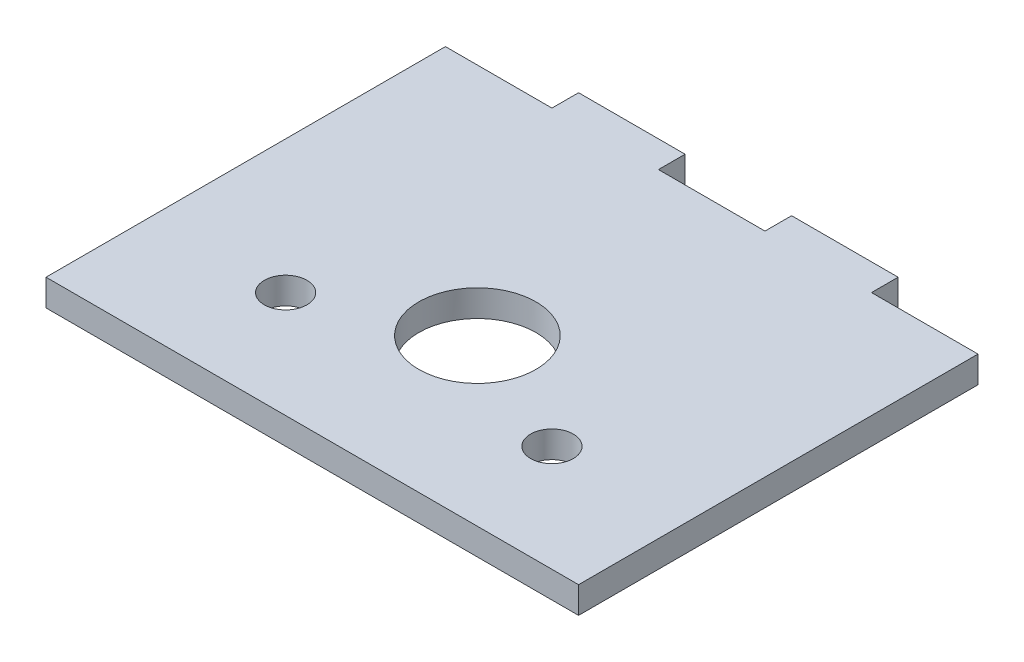
ISO-10303-21;
HEADER;
FILE_DESCRIPTION(('STEP AP214'),'2;1');
FILE_NAME('part.step','',(''),(''),'','','');
FILE_SCHEMA(('AUTOMOTIVE_DESIGN { 1 0 10303 214 1 1 1 1 }'));
ENDSEC;
DATA;
#1=APPLICATION_CONTEXT('core data for automotive mechanical design processes');
#2=APPLICATION_PROTOCOL_DEFINITION('international standard','automotive_design',2000,#1);
#3=PRODUCT_CONTEXT('',#1,'mechanical');
#4=PRODUCT('Part','Part','',(#3));
#5=PRODUCT_RELATED_PRODUCT_CATEGORY('part','',(#4));
#6=PRODUCT_DEFINITION_FORMATION('','',#4);
#7=PRODUCT_DEFINITION_CONTEXT('part definition',#1,'design');
#8=PRODUCT_DEFINITION('design','',#6,#7);
#9=PRODUCT_DEFINITION_SHAPE('','',#8);
#10=(LENGTH_UNIT() NAMED_UNIT(*) SI_UNIT(.MILLI.,.METRE.));
#11=(NAMED_UNIT(*) PLANE_ANGLE_UNIT() SI_UNIT($,.RADIAN.));
#12=(NAMED_UNIT(*) SI_UNIT($,.STERADIAN.) SOLID_ANGLE_UNIT());
#13=UNCERTAINTY_MEASURE_WITH_UNIT(LENGTH_MEASURE(1.E-05),#10,'distance_accuracy_value','');
#14=(GEOMETRIC_REPRESENTATION_CONTEXT(3) GLOBAL_UNCERTAINTY_ASSIGNED_CONTEXT((#13)) GLOBAL_UNIT_ASSIGNED_CONTEXT((#10,
#11,#12)) REPRESENTATION_CONTEXT('',''));
#15=CARTESIAN_POINT('',(0.,0.,0.));
#16=DIRECTION('',(0.,0.,1.));
#17=DIRECTION('',(1.,0.,0.));
#18=AXIS2_PLACEMENT_3D('',#15,#16,#17);
#19=CARTESIAN_POINT('',(0.,5.,0.));
#20=DIRECTION('',(0.,-1.,0.));
#21=DIRECTION('',(0.,0.,-1.));
#22=AXIS2_PLACEMENT_3D('',#19,#20,#21);
#23=PLANE('',#22);
#24=CARTESIAN_POINT('',(0.,5.,0.));
#25=DIRECTION('',(0.,1.,0.));
#26=DIRECTION('',(0.,0.,1.));
#27=AXIS2_PLACEMENT_3D('',#24,#25,#26);
#28=CIRCLE('',#27,11.);
#29=CARTESIAN_POINT('',(0.,5.,11.));
#30=VERTEX_POINT('',#29);
#31=EDGE_CURVE('E281',#30,#30,#28,.T.);
#32=ORIENTED_EDGE('',*,*,#31,.F.);
#33=EDGE_LOOP('',(#32));
#34=FACE_BOUND('',#33,.T.);
#35=DIRECTION('',(0.,0.,1.));
#36=VECTOR('',#35,1.);
#37=CARTESIAN_POINT('',(-50.,5.,31.));
#38=LINE('',#37,#36);
#39=CARTESIAN_POINT('',(-50.,5.,-44.));
#40=VERTEX_POINT('',#39);
#41=CARTESIAN_POINT('',(-50.,5.,31.));
#42=VERTEX_POINT('',#41);
#43=EDGE_CURVE('E178',#40,#42,#38,.T.);
#44=ORIENTED_EDGE('',*,*,#43,.T.);
#45=DIRECTION('',(1.,0.,0.));
#46=VECTOR('',#45,1.);
#47=CARTESIAN_POINT('',(-50.,5.,31.));
#48=LINE('',#47,#46);
#49=CARTESIAN_POINT('',(50.,5.,31.));
#50=VERTEX_POINT('',#49);
#51=EDGE_CURVE('E106',#42,#50,#48,.T.);
#52=ORIENTED_EDGE('',*,*,#51,.T.);
#53=DIRECTION('',(0.,0.,-1.));
#54=VECTOR('',#53,1.);
#55=CARTESIAN_POINT('',(50.,5.,31.));
#56=LINE('',#55,#54);
#57=CARTESIAN_POINT('',(50.,5.,-44.));
#58=VERTEX_POINT('',#57);
#59=EDGE_CURVE('E205',#50,#58,#56,.T.);
#60=ORIENTED_EDGE('',*,*,#59,.T.);
#61=DIRECTION('',(-1.,0.,0.));
#62=VECTOR('',#61,1.);
#63=CARTESIAN_POINT('',(30.,5.,-44.));
#64=LINE('',#63,#62);
#65=CARTESIAN_POINT('',(30.,5.,-44.));
#66=VERTEX_POINT('',#65);
#67=EDGE_CURVE('E224',#58,#66,#64,.T.);
#68=ORIENTED_EDGE('',*,*,#67,.T.);
#69=DIRECTION('',(0.,0.,-1.));
#70=VECTOR('',#69,1.);
#71=CARTESIAN_POINT('',(30.,5.,-49.));
#72=LINE('',#71,#70);
#73=CARTESIAN_POINT('',(30.,5.,-49.));
#74=VERTEX_POINT('',#73);
#75=EDGE_CURVE('E221',#66,#74,#72,.T.);
#76=ORIENTED_EDGE('',*,*,#75,.T.);
#77=DIRECTION('',(-1.,0.,0.));
#78=VECTOR('',#77,1.);
#79=CARTESIAN_POINT('',(10.,5.,-49.));
#80=LINE('',#79,#78);
#81=CARTESIAN_POINT('',(10.,5.,-49.));
#82=VERTEX_POINT('',#81);
#83=EDGE_CURVE('E223',#74,#82,#80,.T.);
#84=ORIENTED_EDGE('',*,*,#83,.T.);
#85=DIRECTION('',(0.,0.,1.));
#86=VECTOR('',#85,1.);
#87=CARTESIAN_POINT('',(10.,5.,-49.));
#88=LINE('',#87,#86);
#89=CARTESIAN_POINT('',(10.,5.,-44.));
#90=VERTEX_POINT('',#89);
#91=EDGE_CURVE('E226',#82,#90,#88,.T.);
#92=ORIENTED_EDGE('',*,*,#91,.T.);
#93=DIRECTION('',(-1.,0.,0.));
#94=VECTOR('',#93,1.);
#95=CARTESIAN_POINT('',(-10.,5.,-44.));
#96=LINE('',#95,#94);
#97=CARTESIAN_POINT('',(-10.,5.,-44.));
#98=VERTEX_POINT('',#97);
#99=EDGE_CURVE('E232',#90,#98,#96,.T.);
#100=ORIENTED_EDGE('',*,*,#99,.T.);
#101=DIRECTION('',(0.,0.,-1.));
#102=VECTOR('',#101,1.);
#103=CARTESIAN_POINT('',(-10.,5.,-49.));
#104=LINE('',#103,#102);
#105=CARTESIAN_POINT('',(-10.,5.,-49.));
#106=VERTEX_POINT('',#105);
#107=EDGE_CURVE('E137',#98,#106,#104,.T.);
#108=ORIENTED_EDGE('',*,*,#107,.T.);
#109=DIRECTION('',(-1.,0.,0.));
#110=VECTOR('',#109,1.);
#111=CARTESIAN_POINT('',(-30.,5.,-49.));
#112=LINE('',#111,#110);
#113=CARTESIAN_POINT('',(-30.,5.,-49.));
#114=VERTEX_POINT('',#113);
#115=EDGE_CURVE('E131',#106,#114,#112,.T.);
#116=ORIENTED_EDGE('',*,*,#115,.T.);
#117=DIRECTION('',(0.,0.,1.));
#118=VECTOR('',#117,1.);
#119=CARTESIAN_POINT('',(-30.,5.,-49.));
#120=LINE('',#119,#118);
#121=CARTESIAN_POINT('',(-30.,5.,-44.));
#122=VERTEX_POINT('',#121);
#123=EDGE_CURVE('E135',#114,#122,#120,.T.);
#124=ORIENTED_EDGE('',*,*,#123,.T.);
#125=DIRECTION('',(-1.,0.,0.));
#126=VECTOR('',#125,1.);
#127=CARTESIAN_POINT('',(-50.,5.,-44.));
#128=LINE('',#127,#126);
#129=EDGE_CURVE('E51',#122,#40,#128,.T.);
#130=ORIENTED_EDGE('',*,*,#129,.T.);
#131=EDGE_LOOP('',(#44,#52,#60,#68,#76,#84,#92,#100,#108,#116,#124,#130));
#132=FACE_BOUND('',#131,.T.);
#133=CARTESIAN_POINT('',(25.,5.,11.));
#134=DIRECTION('',(0.,1.,0.));
#135=DIRECTION('',(0.,0.,1.));
#136=AXIS2_PLACEMENT_3D('',#133,#134,#135);
#137=CIRCLE('',#136,4.00000000000001);
#138=CARTESIAN_POINT('',(25.,5.,15.));
#139=VERTEX_POINT('',#138);
#140=EDGE_CURVE('E159',#139,#139,#137,.T.);
#141=ORIENTED_EDGE('',*,*,#140,.F.);
#142=EDGE_LOOP('',(#141));
#143=FACE_BOUND('',#142,.T.);
#144=CARTESIAN_POINT('',(-25.,5.,11.));
#145=DIRECTION('',(0.,1.,0.));
#146=DIRECTION('',(0.,0.,-1.));
#147=AXIS2_PLACEMENT_3D('',#144,#145,#146);
#148=CIRCLE('',#147,3.99999999999996);
#149=CARTESIAN_POINT('',(-25.,5.,7.00000000000005));
#150=VERTEX_POINT('',#149);
#151=EDGE_CURVE('E285',#150,#150,#148,.T.);
#152=ORIENTED_EDGE('',*,*,#151,.F.);
#153=EDGE_LOOP('',(#152));
#154=FACE_BOUND('',#153,.T.);
#155=ADVANCED_FACE('F34',(#34,#132,#143,#154),#23,.F.);
#156=CARTESIAN_POINT('',(0.,0.,0.));
#157=DIRECTION('',(0.,-1.,0.));
#158=DIRECTION('',(0.,0.,-1.));
#159=AXIS2_PLACEMENT_3D('',#156,#157,#158);
#160=PLANE('',#159);
#161=CARTESIAN_POINT('',(0.,0.,0.));
#162=DIRECTION('',(0.,-1.,0.));
#163=DIRECTION('',(0.,0.,-1.));
#164=AXIS2_PLACEMENT_3D('',#161,#162,#163);
#165=CIRCLE('',#164,11.);
#166=CARTESIAN_POINT('',(0.,0.,-11.));
#167=VERTEX_POINT('',#166);
#168=EDGE_CURVE('E279',#167,#167,#165,.F.);
#169=ORIENTED_EDGE('',*,*,#168,.T.);
#170=EDGE_LOOP('',(#169));
#171=FACE_BOUND('',#170,.T.);
#172=CARTESIAN_POINT('',(25.,0.,11.));
#173=DIRECTION('',(0.,1.,0.));
#174=DIRECTION('',(0.,0.,1.));
#175=AXIS2_PLACEMENT_3D('',#172,#173,#174);
#176=CIRCLE('',#175,4.00000000000001);
#177=CARTESIAN_POINT('',(25.,0.,15.));
#178=VERTEX_POINT('',#177);
#179=EDGE_CURVE('E290',#178,#178,#176,.T.);
#180=ORIENTED_EDGE('',*,*,#179,.T.);
#181=EDGE_LOOP('',(#180));
#182=FACE_BOUND('',#181,.T.);
#183=DIRECTION('',(0.,0.,1.));
#184=VECTOR('',#183,1.);
#185=CARTESIAN_POINT('',(-50.,0.,31.));
#186=LINE('',#185,#184);
#187=CARTESIAN_POINT('',(-50.,0.,-44.));
#188=VERTEX_POINT('',#187);
#189=CARTESIAN_POINT('',(-50.,0.,31.));
#190=VERTEX_POINT('',#189);
#191=EDGE_CURVE('E155',#188,#190,#186,.T.);
#192=ORIENTED_EDGE('',*,*,#191,.F.);
#193=DIRECTION('',(-1.,0.,0.));
#194=VECTOR('',#193,1.);
#195=CARTESIAN_POINT('',(-50.,0.,-44.));
#196=LINE('',#195,#194);
#197=CARTESIAN_POINT('',(-30.,0.,-44.));
#198=VERTEX_POINT('',#197);
#199=EDGE_CURVE('E98',#198,#188,#196,.T.);
#200=ORIENTED_EDGE('',*,*,#199,.F.);
#201=DIRECTION('',(0.,0.,1.));
#202=VECTOR('',#201,1.);
#203=CARTESIAN_POINT('',(-30.,0.,-49.));
#204=LINE('',#203,#202);
#205=CARTESIAN_POINT('',(-30.,0.,-49.));
#206=VERTEX_POINT('',#205);
#207=EDGE_CURVE('E92',#206,#198,#204,.T.);
#208=ORIENTED_EDGE('',*,*,#207,.F.);
#209=DIRECTION('',(-1.,0.,0.));
#210=VECTOR('',#209,1.);
#211=CARTESIAN_POINT('',(-30.,0.,-49.));
#212=LINE('',#211,#210);
#213=CARTESIAN_POINT('',(-10.,0.,-49.));
#214=VERTEX_POINT('',#213);
#215=EDGE_CURVE('E145',#214,#206,#212,.T.);
#216=ORIENTED_EDGE('',*,*,#215,.F.);
#217=DIRECTION('',(0.,0.,-1.));
#218=VECTOR('',#217,1.);
#219=CARTESIAN_POINT('',(-10.,0.,-49.));
#220=LINE('',#219,#218);
#221=CARTESIAN_POINT('',(-10.,0.,-44.));
#222=VERTEX_POINT('',#221);
#223=EDGE_CURVE('E173',#222,#214,#220,.T.);
#224=ORIENTED_EDGE('',*,*,#223,.F.);
#225=DIRECTION('',(-1.,0.,0.));
#226=VECTOR('',#225,1.);
#227=CARTESIAN_POINT('',(-10.,0.,-44.));
#228=LINE('',#227,#226);
#229=CARTESIAN_POINT('',(10.,0.,-44.));
#230=VERTEX_POINT('',#229);
#231=EDGE_CURVE('E171',#230,#222,#228,.T.);
#232=ORIENTED_EDGE('',*,*,#231,.F.);
#233=DIRECTION('',(0.,0.,1.));
#234=VECTOR('',#233,1.);
#235=CARTESIAN_POINT('',(10.,0.,-49.));
#236=LINE('',#235,#234);
#237=CARTESIAN_POINT('',(10.,0.,-49.));
#238=VERTEX_POINT('',#237);
#239=EDGE_CURVE('E169',#238,#230,#236,.T.);
#240=ORIENTED_EDGE('',*,*,#239,.F.);
#241=DIRECTION('',(-1.,0.,0.));
#242=VECTOR('',#241,1.);
#243=CARTESIAN_POINT('',(10.,0.,-49.));
#244=LINE('',#243,#242);
#245=CARTESIAN_POINT('',(30.,0.,-49.));
#246=VERTEX_POINT('',#245);
#247=EDGE_CURVE('E167',#246,#238,#244,.T.);
#248=ORIENTED_EDGE('',*,*,#247,.F.);
#249=DIRECTION('',(0.,0.,-1.));
#250=VECTOR('',#249,1.);
#251=CARTESIAN_POINT('',(30.,0.,-49.));
#252=LINE('',#251,#250);
#253=CARTESIAN_POINT('',(30.,0.,-44.));
#254=VERTEX_POINT('',#253);
#255=EDGE_CURVE('E165',#254,#246,#252,.T.);
#256=ORIENTED_EDGE('',*,*,#255,.F.);
#257=DIRECTION('',(-1.,0.,0.));
#258=VECTOR('',#257,1.);
#259=CARTESIAN_POINT('',(30.,0.,-44.));
#260=LINE('',#259,#258);
#261=CARTESIAN_POINT('',(50.,0.,-44.));
#262=VERTEX_POINT('',#261);
#263=EDGE_CURVE('E163',#262,#254,#260,.T.);
#264=ORIENTED_EDGE('',*,*,#263,.F.);
#265=DIRECTION('',(0.,0.,-1.));
#266=VECTOR('',#265,1.);
#267=CARTESIAN_POINT('',(50.,0.,31.));
#268=LINE('',#267,#266);
#269=CARTESIAN_POINT('',(50.,0.,31.));
#270=VERTEX_POINT('',#269);
#271=EDGE_CURVE('E161',#270,#262,#268,.T.);
#272=ORIENTED_EDGE('',*,*,#271,.F.);
#273=DIRECTION('',(1.,0.,0.));
#274=VECTOR('',#273,1.);
#275=CARTESIAN_POINT('',(-50.,0.,31.));
#276=LINE('',#275,#274);
#277=EDGE_CURVE('E158',#190,#270,#276,.T.);
#278=ORIENTED_EDGE('',*,*,#277,.F.);
#279=EDGE_LOOP('',(#192,#200,#208,#216,#224,#232,#240,#248,#256,#264,#272,#278));
#280=FACE_BOUND('',#279,.T.);
#281=CARTESIAN_POINT('',(-25.,0.,11.));
#282=DIRECTION('',(0.,1.,0.));
#283=DIRECTION('',(0.,0.,-1.));
#284=AXIS2_PLACEMENT_3D('',#281,#282,#283);
#285=CIRCLE('',#284,3.99999999999996);
#286=CARTESIAN_POINT('',(-25.,0.,7.00000000000005));
#287=VERTEX_POINT('',#286);
#288=EDGE_CURVE('E282',#287,#287,#285,.T.);
#289=ORIENTED_EDGE('',*,*,#288,.T.);
#290=EDGE_LOOP('',(#289));
#291=FACE_BOUND('',#290,.T.);
#292=ADVANCED_FACE('F209',(#171,#182,#280,#291),#160,.T.);
#293=CARTESIAN_POINT('',(-50.,5.,31.));
#294=DIRECTION('',(1.,0.,0.));
#295=DIRECTION('',(0.,0.,-1.));
#296=AXIS2_PLACEMENT_3D('',#293,#294,#295);
#297=PLANE('',#296);
#298=ORIENTED_EDGE('',*,*,#191,.T.);
#299=DIRECTION('',(0.,-1.,0.));
#300=VECTOR('',#299,1.);
#301=CARTESIAN_POINT('',(-50.,5.,31.));
#302=LINE('',#301,#300);
#303=EDGE_CURVE('E11',#42,#190,#302,.T.);
#304=ORIENTED_EDGE('',*,*,#303,.F.);
#305=ORIENTED_EDGE('',*,*,#43,.F.);
#306=DIRECTION('',(0.,-1.,0.));
#307=VECTOR('',#306,1.);
#308=CARTESIAN_POINT('',(-50.,5.,-44.));
#309=LINE('',#308,#307);
#310=EDGE_CURVE('E151',#40,#188,#309,.T.);
#311=ORIENTED_EDGE('',*,*,#310,.T.);
#312=EDGE_LOOP('',(#298,#304,#305,#311));
#313=FACE_BOUND('',#312,.T.);
#314=ADVANCED_FACE('F36',(#313),#297,.F.);
#315=CARTESIAN_POINT('',(-50.,5.,31.));
#316=DIRECTION('',(0.,0.,-1.));
#317=DIRECTION('',(-1.,0.,0.));
#318=AXIS2_PLACEMENT_3D('',#315,#316,#317);
#319=PLANE('',#318);
#320=ORIENTED_EDGE('',*,*,#277,.T.);
#321=DIRECTION('',(0.,-1.,0.));
#322=VECTOR('',#321,1.);
#323=CARTESIAN_POINT('',(50.,5.,31.));
#324=LINE('',#323,#322);
#325=EDGE_CURVE('E43',#50,#270,#324,.T.);
#326=ORIENTED_EDGE('',*,*,#325,.F.);
#327=ORIENTED_EDGE('',*,*,#51,.F.);
#328=ORIENTED_EDGE('',*,*,#303,.T.);
#329=EDGE_LOOP('',(#320,#326,#327,#328));
#330=FACE_BOUND('',#329,.T.);
#331=ADVANCED_FACE('F393',(#330),#319,.F.);
#332=CARTESIAN_POINT('',(50.,5.,31.));
#333=DIRECTION('',(-1.,0.,0.));
#334=DIRECTION('',(0.,0.,1.));
#335=AXIS2_PLACEMENT_3D('',#332,#333,#334);
#336=PLANE('',#335);
#337=ORIENTED_EDGE('',*,*,#271,.T.);
#338=DIRECTION('',(0.,-1.,0.));
#339=VECTOR('',#338,1.);
#340=CARTESIAN_POINT('',(50.,5.,-44.));
#341=LINE('',#340,#339);
#342=EDGE_CURVE('E197',#58,#262,#341,.T.);
#343=ORIENTED_EDGE('',*,*,#342,.F.);
#344=ORIENTED_EDGE('',*,*,#59,.F.);
#345=ORIENTED_EDGE('',*,*,#325,.T.);
#346=EDGE_LOOP('',(#337,#343,#344,#345));
#347=FACE_BOUND('',#346,.T.);
#348=ADVANCED_FACE('F203',(#347),#336,.F.);
#349=CARTESIAN_POINT('',(30.,5.,-44.));
#350=DIRECTION('',(0.,0.,1.));
#351=DIRECTION('',(1.,0.,0.));
#352=AXIS2_PLACEMENT_3D('',#349,#350,#351);
#353=PLANE('',#352);
#354=ORIENTED_EDGE('',*,*,#263,.T.);
#355=DIRECTION('',(0.,-1.,0.));
#356=VECTOR('',#355,1.);
#357=CARTESIAN_POINT('',(30.,5.,-44.));
#358=LINE('',#357,#356);
#359=EDGE_CURVE('E194',#66,#254,#358,.T.);
#360=ORIENTED_EDGE('',*,*,#359,.F.);
#361=ORIENTED_EDGE('',*,*,#67,.F.);
#362=ORIENTED_EDGE('',*,*,#342,.T.);
#363=EDGE_LOOP('',(#354,#360,#361,#362));
#364=FACE_BOUND('',#363,.T.);
#365=ADVANCED_FACE('F215',(#364),#353,.F.);
#366=CARTESIAN_POINT('',(30.,5.,-49.));
#367=DIRECTION('',(-1.,0.,0.));
#368=DIRECTION('',(0.,0.,1.));
#369=AXIS2_PLACEMENT_3D('',#366,#367,#368);
#370=PLANE('',#369);
#371=ORIENTED_EDGE('',*,*,#255,.T.);
#372=DIRECTION('',(0.,-1.,0.));
#373=VECTOR('',#372,1.);
#374=CARTESIAN_POINT('',(30.,5.,-49.));
#375=LINE('',#374,#373);
#376=EDGE_CURVE('E191',#74,#246,#375,.T.);
#377=ORIENTED_EDGE('',*,*,#376,.F.);
#378=ORIENTED_EDGE('',*,*,#75,.F.);
#379=ORIENTED_EDGE('',*,*,#359,.T.);
#380=EDGE_LOOP('',(#371,#377,#378,#379));
#381=FACE_BOUND('',#380,.T.);
#382=ADVANCED_FACE('F219',(#381),#370,.F.);
#383=CARTESIAN_POINT('',(10.,5.,-49.));
#384=DIRECTION('',(0.,0.,1.));
#385=DIRECTION('',(1.,0.,0.));
#386=AXIS2_PLACEMENT_3D('',#383,#384,#385);
#387=PLANE('',#386);
#388=ORIENTED_EDGE('',*,*,#247,.T.);
#389=DIRECTION('',(0.,-1.,0.));
#390=VECTOR('',#389,1.);
#391=CARTESIAN_POINT('',(10.,5.,-49.));
#392=LINE('',#391,#390);
#393=EDGE_CURVE('E188',#82,#238,#392,.T.);
#394=ORIENTED_EDGE('',*,*,#393,.F.);
#395=ORIENTED_EDGE('',*,*,#83,.F.);
#396=ORIENTED_EDGE('',*,*,#376,.T.);
#397=EDGE_LOOP('',(#388,#394,#395,#396));
#398=FACE_BOUND('',#397,.T.);
#399=ADVANCED_FACE('F358',(#398),#387,.F.);
#400=CARTESIAN_POINT('',(10.,5.,-49.));
#401=DIRECTION('',(1.,0.,0.));
#402=DIRECTION('',(0.,0.,-1.));
#403=AXIS2_PLACEMENT_3D('',#400,#401,#402);
#404=PLANE('',#403);
#405=ORIENTED_EDGE('',*,*,#239,.T.);
#406=DIRECTION('',(0.,-1.,0.));
#407=VECTOR('',#406,1.);
#408=CARTESIAN_POINT('',(10.,5.,-44.));
#409=LINE('',#408,#407);
#410=EDGE_CURVE('E185',#90,#230,#409,.T.);
#411=ORIENTED_EDGE('',*,*,#410,.F.);
#412=ORIENTED_EDGE('',*,*,#91,.F.);
#413=ORIENTED_EDGE('',*,*,#393,.T.);
#414=EDGE_LOOP('',(#405,#411,#412,#413));
#415=FACE_BOUND('',#414,.T.);
#416=ADVANCED_FACE('F349',(#415),#404,.F.);
#417=CARTESIAN_POINT('',(-10.,5.,-44.));
#418=DIRECTION('',(0.,0.,1.));
#419=DIRECTION('',(1.,0.,0.));
#420=AXIS2_PLACEMENT_3D('',#417,#418,#419);
#421=PLANE('',#420);
#422=ORIENTED_EDGE('',*,*,#231,.T.);
#423=DIRECTION('',(0.,-1.,0.));
#424=VECTOR('',#423,1.);
#425=CARTESIAN_POINT('',(-10.,5.,-44.));
#426=LINE('',#425,#424);
#427=EDGE_CURVE('E182',#98,#222,#426,.T.);
#428=ORIENTED_EDGE('',*,*,#427,.F.);
#429=ORIENTED_EDGE('',*,*,#99,.F.);
#430=ORIENTED_EDGE('',*,*,#410,.T.);
#431=EDGE_LOOP('',(#422,#428,#429,#430));
#432=FACE_BOUND('',#431,.T.);
#433=ADVANCED_FACE('F238',(#432),#421,.F.);
#434=CARTESIAN_POINT('',(-10.,5.,-49.));
#435=DIRECTION('',(-1.,0.,0.));
#436=DIRECTION('',(0.,0.,1.));
#437=AXIS2_PLACEMENT_3D('',#434,#435,#436);
#438=PLANE('',#437);
#439=ORIENTED_EDGE('',*,*,#223,.T.);
#440=DIRECTION('',(0.,-1.,0.));
#441=VECTOR('',#440,1.);
#442=CARTESIAN_POINT('',(-10.,5.,-49.));
#443=LINE('',#442,#441);
#444=EDGE_CURVE('E146',#106,#214,#443,.T.);
#445=ORIENTED_EDGE('',*,*,#444,.F.);
#446=ORIENTED_EDGE('',*,*,#107,.F.);
#447=ORIENTED_EDGE('',*,*,#427,.T.);
#448=EDGE_LOOP('',(#439,#445,#446,#447));
#449=FACE_BOUND('',#448,.T.);
#450=ADVANCED_FACE('F242',(#449),#438,.F.);
#451=CARTESIAN_POINT('',(-30.,5.,-49.));
#452=DIRECTION('',(0.,0.,1.));
#453=DIRECTION('',(1.,0.,0.));
#454=AXIS2_PLACEMENT_3D('',#451,#452,#453);
#455=PLANE('',#454);
#456=ORIENTED_EDGE('',*,*,#215,.T.);
#457=DIRECTION('',(0.,-1.,0.));
#458=VECTOR('',#457,1.);
#459=CARTESIAN_POINT('',(-30.,5.,-49.));
#460=LINE('',#459,#458);
#461=EDGE_CURVE('E142',#114,#206,#460,.T.);
#462=ORIENTED_EDGE('',*,*,#461,.F.);
#463=ORIENTED_EDGE('',*,*,#115,.F.);
#464=ORIENTED_EDGE('',*,*,#444,.T.);
#465=EDGE_LOOP('',(#456,#462,#463,#464));
#466=FACE_BOUND('',#465,.T.);
#467=ADVANCED_FACE('F143',(#466),#455,.F.);
#468=CARTESIAN_POINT('',(-30.,5.,-49.));
#469=DIRECTION('',(1.,0.,0.));
#470=DIRECTION('',(0.,0.,-1.));
#471=AXIS2_PLACEMENT_3D('',#468,#469,#470);
#472=PLANE('',#471);
#473=ORIENTED_EDGE('',*,*,#207,.T.);
#474=DIRECTION('',(0.,-1.,0.));
#475=VECTOR('',#474,1.);
#476=CARTESIAN_POINT('',(-30.,5.,-44.));
#477=LINE('',#476,#475);
#478=EDGE_CURVE('E147',#122,#198,#477,.T.);
#479=ORIENTED_EDGE('',*,*,#478,.F.);
#480=ORIENTED_EDGE('',*,*,#123,.F.);
#481=ORIENTED_EDGE('',*,*,#461,.T.);
#482=EDGE_LOOP('',(#473,#479,#480,#481));
#483=FACE_BOUND('',#482,.T.);
#484=ADVANCED_FACE('F149',(#483),#472,.F.);
#485=CARTESIAN_POINT('',(-50.,5.,-44.));
#486=DIRECTION('',(0.,0.,1.));
#487=DIRECTION('',(1.,0.,0.));
#488=AXIS2_PLACEMENT_3D('',#485,#486,#487);
#489=PLANE('',#488);
#490=ORIENTED_EDGE('',*,*,#199,.T.);
#491=ORIENTED_EDGE('',*,*,#310,.F.);
#492=ORIENTED_EDGE('',*,*,#129,.F.);
#493=ORIENTED_EDGE('',*,*,#478,.T.);
#494=EDGE_LOOP('',(#490,#491,#492,#493));
#495=FACE_BOUND('',#494,.T.);
#496=ADVANCED_FACE('F246',(#495),#489,.F.);
#497=CARTESIAN_POINT('',(25.,5.,11.));
#498=DIRECTION('',(0.,-1.,0.));
#499=DIRECTION('',(0.,0.,-1.));
#500=AXIS2_PLACEMENT_3D('',#497,#498,#499);
#501=CYLINDRICAL_SURFACE('',#500,4.00000000000001);
#502=ORIENTED_EDGE('',*,*,#140,.T.);
#503=EDGE_LOOP('',(#502));
#504=FACE_BOUND('',#503,.T.);
#505=ORIENTED_EDGE('',*,*,#179,.F.);
#506=EDGE_LOOP('',(#505));
#507=FACE_BOUND('',#506,.T.);
#508=ADVANCED_FACE('F248',(#504,#507),#501,.F.);
#509=CARTESIAN_POINT('',(-25.,5.,11.));
#510=DIRECTION('',(0.,-1.,0.));
#511=DIRECTION('',(0.,0.,-1.));
#512=AXIS2_PLACEMENT_3D('',#509,#510,#511);
#513=CYLINDRICAL_SURFACE('',#512,3.99999999999996);
#514=ORIENTED_EDGE('',*,*,#151,.T.);
#515=EDGE_LOOP('',(#514));
#516=FACE_BOUND('',#515,.T.);
#517=ORIENTED_EDGE('',*,*,#288,.F.);
#518=EDGE_LOOP('',(#517));
#519=FACE_BOUND('',#518,.T.);
#520=ADVANCED_FACE('F254',(#516,#519),#513,.F.);
#521=CARTESIAN_POINT('',(0.,-0.00100000000000013,0.));
#522=DIRECTION('',(0.,1.,0.));
#523=DIRECTION('',(0.,0.,1.));
#524=AXIS2_PLACEMENT_3D('',#521,#522,#523);
#525=CYLINDRICAL_SURFACE('',#524,11.);
#526=ORIENTED_EDGE('',*,*,#168,.F.);
#527=EDGE_LOOP('',(#526));
#528=FACE_BOUND('',#527,.T.);
#529=ORIENTED_EDGE('',*,*,#31,.T.);
#530=EDGE_LOOP('',(#529));
#531=FACE_BOUND('',#530,.T.);
#532=ADVANCED_FACE('F270',(#528,#531),#525,.F.);
#533=CLOSED_SHELL('',(#155,#292,#314,#331,#348,#365,#382,#399,#416,#433,#450,#467,#484,#496,
#508,#520,#532));
#534=MANIFOLD_SOLID_BREP('B2',#533);
#535=ADVANCED_BREP_SHAPE_REPRESENTATION('',(#18,#534),#14);
#536=SHAPE_DEFINITION_REPRESENTATION(#9,#535);
ENDSEC;
END-ISO-10303-21;
